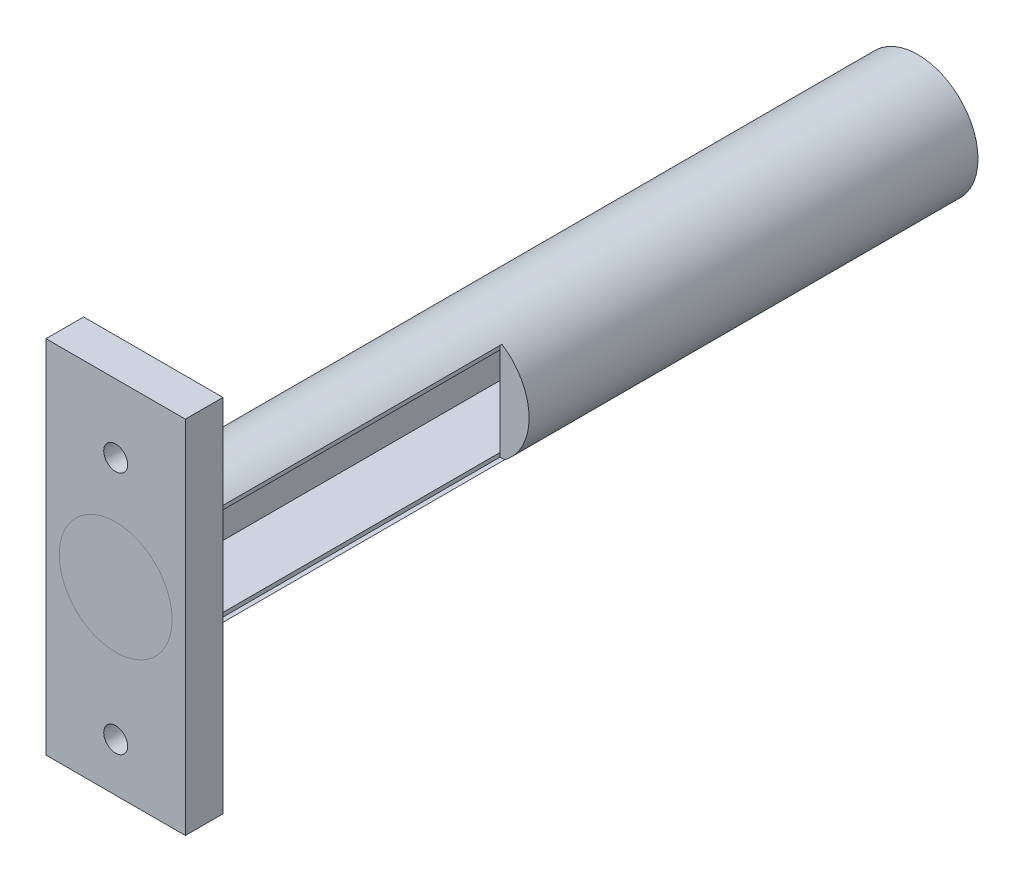
ISO-10303-21;
HEADER;
FILE_DESCRIPTION(('STEP AP214'),'2;1');
FILE_NAME('part.step','',(''),(''),'','','');
FILE_SCHEMA(('AUTOMOTIVE_DESIGN { 1 0 10303 214 1 1 1 1 }'));
ENDSEC;
DATA;
#1=APPLICATION_CONTEXT('core data for automotive mechanical design processes');
#2=APPLICATION_PROTOCOL_DEFINITION('international standard','automotive_design',2000,#1);
#3=PRODUCT_CONTEXT('',#1,'mechanical');
#4=PRODUCT('Part','Part','',(#3));
#5=PRODUCT_RELATED_PRODUCT_CATEGORY('part','',(#4));
#6=PRODUCT_DEFINITION_FORMATION('','',#4);
#7=PRODUCT_DEFINITION_CONTEXT('part definition',#1,'design');
#8=PRODUCT_DEFINITION('design','',#6,#7);
#9=PRODUCT_DEFINITION_SHAPE('','',#8);
#10=(LENGTH_UNIT() NAMED_UNIT(*) SI_UNIT(.MILLI.,.METRE.));
#11=(NAMED_UNIT(*) PLANE_ANGLE_UNIT() SI_UNIT($,.RADIAN.));
#12=(NAMED_UNIT(*) SI_UNIT($,.STERADIAN.) SOLID_ANGLE_UNIT());
#13=UNCERTAINTY_MEASURE_WITH_UNIT(LENGTH_MEASURE(1.E-05),#10,'distance_accuracy_value','');
#14=(GEOMETRIC_REPRESENTATION_CONTEXT(3) GLOBAL_UNCERTAINTY_ASSIGNED_CONTEXT((#13)) GLOBAL_UNIT_ASSIGNED_CONTEXT((#10,
#11,#12)) REPRESENTATION_CONTEXT('',''));
#15=CARTESIAN_POINT('',(0.,0.,0.));
#16=DIRECTION('',(0.,0.,1.));
#17=DIRECTION('',(1.,0.,0.));
#18=AXIS2_PLACEMENT_3D('',#15,#16,#17);
#19=CARTESIAN_POINT('',(4.1400160952072,-5.90118643022332,100.));
#20=DIRECTION('',(1.,0.,0.));
#21=DIRECTION('',(0.,0.,-1.));
#22=AXIS2_PLACEMENT_3D('',#19,#20,#21);
#23=PLANE('',#22);
#24=DIRECTION('',(0.,-1.,0.));
#25=VECTOR('',#24,1.);
#26=CARTESIAN_POINT('',(4.1400160952072,-6.44277888737755,59.6569720384821));
#27=LINE('',#26,#25);
#28=CARTESIAN_POINT('',(4.1400160952072,5.90118643022332,59.6569720384821));
#29=VERTEX_POINT('',#28);
#30=CARTESIAN_POINT('',(4.1400160952072,-5.90118643022332,59.6569720384821));
#31=VERTEX_POINT('',#30);
#32=EDGE_CURVE('E214',#29,#31,#27,.T.);
#33=ORIENTED_EDGE('',*,*,#32,.F.);
#34=DIRECTION('',(0.,0.,-1.));
#35=VECTOR('',#34,1.);
#36=CARTESIAN_POINT('',(4.1400160952072,5.90118643022332,100.));
#37=LINE('',#36,#35);
#38=CARTESIAN_POINT('',(4.1400160952072,5.90118643022332,4.));
#39=VERTEX_POINT('',#38);
#40=EDGE_CURVE('E277',#29,#39,#37,.T.);
#41=ORIENTED_EDGE('',*,*,#40,.T.);
#42=DIRECTION('',(0.,-1.,0.));
#43=VECTOR('',#42,1.);
#44=CARTESIAN_POINT('',(4.1400160952072,-5.90118643022332,4.));
#45=LINE('',#44,#43);
#46=CARTESIAN_POINT('',(4.1400160952072,-5.90118643022332,4.));
#47=VERTEX_POINT('',#46);
#48=EDGE_CURVE('E230',#39,#47,#45,.T.);
#49=ORIENTED_EDGE('',*,*,#48,.T.);
#50=DIRECTION('',(0.,0.,-1.));
#51=VECTOR('',#50,1.);
#52=CARTESIAN_POINT('',(4.1400160952072,-5.90118643022332,100.));
#53=LINE('',#52,#51);
#54=EDGE_CURVE('E257',#31,#47,#53,.T.);
#55=ORIENTED_EDGE('',*,*,#54,.F.);
#56=EDGE_LOOP('',(#33,#41,#49,#55));
#57=FACE_BOUND('',#56,.T.);
#58=ADVANCED_FACE('F41',(#57),#23,.F.);
#59=CARTESIAN_POINT('',(0.,0.,101.6));
#60=DIRECTION('',(0.,0.,-1.));
#61=DIRECTION('',(-1.,0.,0.));
#62=AXIS2_PLACEMENT_3D('',#59,#60,#61);
#63=CYLINDRICAL_SURFACE('',#62,8.);
#64=DIRECTION('',(0.,0.,-1.));
#65=VECTOR('',#64,1.);
#66=CARTESIAN_POINT('',(-5.82160820751879,5.4871557184164,101.6));
#67=LINE('',#66,#65);
#68=CARTESIAN_POINT('',(-5.82160820751879,5.4871557184164,95.8172403209971));
#69=VERTEX_POINT('',#68);
#70=CARTESIAN_POINT('',(-5.82160820751879,5.4871557184164,98.3733791189536));
#71=VERTEX_POINT('',#70);
#72=EDGE_CURVE('E201',#69,#71,#67,.F.);
#73=ORIENTED_EDGE('',*,*,#72,.T.);
#74=CARTESIAN_POINT('',(0.,0.,98.3733791189536));
#75=DIRECTION('',(0.,0.,1.));
#76=DIRECTION('',(1.,0.,0.));
#77=AXIS2_PLACEMENT_3D('',#74,#75,#76);
#78=CIRCLE('',#77,8.);
#79=CARTESIAN_POINT('',(-5.82160820751879,-5.4871557184164,98.3733791189536));
#80=VERTEX_POINT('',#79);
#81=EDGE_CURVE('E205',#71,#80,#78,.T.);
#82=ORIENTED_EDGE('',*,*,#81,.T.);
#83=DIRECTION('',(0.,0.,-1.));
#84=VECTOR('',#83,1.);
#85=CARTESIAN_POINT('',(-5.82160820751879,-5.4871557184164,101.6));
#86=LINE('',#85,#84);
#87=CARTESIAN_POINT('',(-5.82160820751879,-5.4871557184164,95.8172403209971));
#88=VERTEX_POINT('',#87);
#89=EDGE_CURVE('E192',#80,#88,#86,.T.);
#90=ORIENTED_EDGE('',*,*,#89,.T.);
#91=CARTESIAN_POINT('',(0.,0.,95.8172403209971));
#92=DIRECTION('',(0.,0.,-1.));
#93=DIRECTION('',(-1.,0.,0.));
#94=AXIS2_PLACEMENT_3D('',#91,#92,#93);
#95=CIRCLE('',#94,8.);
#96=EDGE_CURVE('E167',#88,#69,#95,.T.);
#97=ORIENTED_EDGE('',*,*,#96,.T.);
#98=EDGE_LOOP('',(#73,#82,#90,#97));
#99=FACE_BOUND('',#98,.T.);
#100=DIRECTION('',(0.,0.,-1.));
#101=VECTOR('',#100,1.);
#102=CARTESIAN_POINT('',(4.40136366689811,6.68041898923333,101.6));
#103=LINE('',#102,#101);
#104=CARTESIAN_POINT('',(4.40136366689811,6.68041898923333,100.347301698491));
#105=VERTEX_POINT('',#104);
#106=CARTESIAN_POINT('',(4.4013636668981,6.68041898923332,59.6569720384821));
#107=VERTEX_POINT('',#106);
#108=EDGE_CURVE('E50',#105,#107,#103,.T.);
#109=ORIENTED_EDGE('',*,*,#108,.T.);
#110=CARTESIAN_POINT('',(0.,0.,59.6569720384821));
#111=DIRECTION('',(0.,0.,-1.));
#112=DIRECTION('',(-1.,0.,0.));
#113=AXIS2_PLACEMENT_3D('',#110,#111,#112);
#114=CIRCLE('',#113,8.);
#115=CARTESIAN_POINT('',(4.74242556171019,-6.44277888737755,59.6569720384821));
#116=VERTEX_POINT('',#115);
#117=EDGE_CURVE('E11',#107,#116,#114,.T.);
#118=ORIENTED_EDGE('',*,*,#117,.T.);
#119=DIRECTION('',(0.,0.,-1.));
#120=VECTOR('',#119,1.);
#121=CARTESIAN_POINT('',(4.74242556171019,-6.44277888737754,101.6));
#122=LINE('',#121,#120);
#123=CARTESIAN_POINT('',(4.74242556171019,-6.44277888737754,100.347301698491));
#124=VERTEX_POINT('',#123);
#125=EDGE_CURVE('E320',#116,#124,#122,.F.);
#126=ORIENTED_EDGE('',*,*,#125,.T.);
#127=CARTESIAN_POINT('',(0.,0.,100.347301698491));
#128=DIRECTION('',(0.,0.,1.));
#129=DIRECTION('',(1.,0.,0.));
#130=AXIS2_PLACEMENT_3D('',#127,#128,#129);
#131=CIRCLE('',#130,8.);
#132=EDGE_CURVE('E373',#124,#105,#131,.T.);
#133=ORIENTED_EDGE('',*,*,#132,.T.);
#134=EDGE_LOOP('',(#109,#118,#126,#133));
#135=FACE_BOUND('',#134,.T.);
#136=CARTESIAN_POINT('',(0.,0.,101.6));
#137=DIRECTION('',(0.,0.,1.));
#138=DIRECTION('',(1.,0.,0.));
#139=AXIS2_PLACEMENT_3D('',#136,#137,#138);
#140=CIRCLE('',#139,8.);
#141=CARTESIAN_POINT('',(8.,0.,101.6));
#142=VERTEX_POINT('',#141);
#143=EDGE_CURVE('E321',#142,#142,#140,.T.);
#144=ORIENTED_EDGE('',*,*,#143,.F.);
#145=EDGE_LOOP('',(#144));
#146=FACE_BOUND('',#145,.T.);
#147=CARTESIAN_POINT('',(0.,0.,0.));
#148=DIRECTION('',(0.,0.,1.));
#149=DIRECTION('',(1.,0.,0.));
#150=AXIS2_PLACEMENT_3D('',#147,#148,#149);
#151=CIRCLE('',#150,8.);
#152=CARTESIAN_POINT('',(8.,0.,0.));
#153=VERTEX_POINT('',#152);
#154=EDGE_CURVE('E363',#153,#153,#151,.T.);
#155=ORIENTED_EDGE('',*,*,#154,.T.);
#156=EDGE_LOOP('',(#155));
#157=FACE_BOUND('',#156,.T.);
#158=ADVANCED_FACE('F43',(#99,#135,#146,#157),#63,.T.);
#159=CARTESIAN_POINT('',(0.,0.,0.));
#160=DIRECTION('',(0.,0.,1.));
#161=DIRECTION('',(1.,0.,0.));
#162=AXIS2_PLACEMENT_3D('',#159,#160,#161);
#163=PLANE('',#162);
#164=CARTESIAN_POINT('',(0.,0.,0.));
#165=DIRECTION('',(0.,0.,-1.));
#166=DIRECTION('',(-1.,0.,0.));
#167=AXIS2_PLACEMENT_3D('',#164,#165,#166);
#168=CIRCLE('',#167,3.185);
#169=CARTESIAN_POINT('',(-3.185,0.,0.));
#170=VERTEX_POINT('',#169);
#171=EDGE_CURVE('E291',#170,#170,#168,.T.);
#172=ORIENTED_EDGE('',*,*,#171,.F.);
#173=EDGE_LOOP('',(#172));
#174=FACE_BOUND('',#173,.T.);
#175=ORIENTED_EDGE('',*,*,#154,.F.);
#176=EDGE_LOOP('',(#175));
#177=FACE_BOUND('',#176,.T.);
#178=ADVANCED_FACE('F438',(#174,#177),#163,.F.);
#179=CARTESIAN_POINT('',(-9.25982346558385,-23.9637087374263,106.6));
#180=DIRECTION('',(1.,0.,0.));
#181=DIRECTION('',(0.,0.,-1.));
#182=AXIS2_PLACEMENT_3D('',#179,#180,#181);
#183=PLANE('',#182);
#184=DIRECTION('',(0.,-1.,0.));
#185=VECTOR('',#184,1.);
#186=CARTESIAN_POINT('',(-9.25982346558385,-23.9637087374263,101.6));
#187=LINE('',#186,#185);
#188=CARTESIAN_POINT('',(-9.25982346558385,23.9637087374263,101.6));
#189=VERTEX_POINT('',#188);
#190=CARTESIAN_POINT('',(-9.25982346558385,-23.9637087374263,101.6));
#191=VERTEX_POINT('',#190);
#192=EDGE_CURVE('E315',#189,#191,#187,.T.);
#193=ORIENTED_EDGE('',*,*,#192,.T.);
#194=DIRECTION('',(0.,0.,-1.));
#195=VECTOR('',#194,1.);
#196=CARTESIAN_POINT('',(-9.25982346558385,-23.9637087374263,106.6));
#197=LINE('',#196,#195);
#198=CARTESIAN_POINT('',(-9.25982346558385,-23.9637087374263,106.6));
#199=VERTEX_POINT('',#198);
#200=EDGE_CURVE('E359',#199,#191,#197,.T.);
#201=ORIENTED_EDGE('',*,*,#200,.F.);
#202=DIRECTION('',(0.,-1.,0.));
#203=VECTOR('',#202,1.);
#204=CARTESIAN_POINT('',(-9.25982346558385,-23.9637087374263,106.6));
#205=LINE('',#204,#203);
#206=CARTESIAN_POINT('',(-9.25982346558385,23.9637087374263,106.6));
#207=VERTEX_POINT('',#206);
#208=EDGE_CURVE('E322',#207,#199,#205,.T.);
#209=ORIENTED_EDGE('',*,*,#208,.F.);
#210=DIRECTION('',(0.,0.,-1.));
#211=VECTOR('',#210,1.);
#212=CARTESIAN_POINT('',(-9.25982346558385,23.9637087374263,106.6));
#213=LINE('',#212,#211);
#214=EDGE_CURVE('E336',#207,#189,#213,.T.);
#215=ORIENTED_EDGE('',*,*,#214,.T.);
#216=EDGE_LOOP('',(#193,#201,#209,#215));
#217=FACE_BOUND('',#216,.T.);
#218=ADVANCED_FACE('F481',(#217),#183,.F.);
#219=CARTESIAN_POINT('',(9.25982346558385,-23.9637087374263,106.6));
#220=DIRECTION('',(0.,1.,0.));
#221=DIRECTION('',(0.,0.,1.));
#222=AXIS2_PLACEMENT_3D('',#219,#220,#221);
#223=PLANE('',#222);
#224=DIRECTION('',(1.,0.,0.));
#225=VECTOR('',#224,1.);
#226=CARTESIAN_POINT('',(9.25982346558385,-23.9637087374263,101.6));
#227=LINE('',#226,#225);
#228=CARTESIAN_POINT('',(9.25982346558385,-23.9637087374263,101.6));
#229=VERTEX_POINT('',#228);
#230=EDGE_CURVE('E340',#191,#229,#227,.T.);
#231=ORIENTED_EDGE('',*,*,#230,.T.);
#232=DIRECTION('',(0.,0.,-1.));
#233=VECTOR('',#232,1.);
#234=CARTESIAN_POINT('',(9.25982346558385,-23.9637087374263,106.6));
#235=LINE('',#234,#233);
#236=CARTESIAN_POINT('',(9.25982346558385,-23.9637087374263,106.6));
#237=VERTEX_POINT('',#236);
#238=EDGE_CURVE('E355',#237,#229,#235,.T.);
#239=ORIENTED_EDGE('',*,*,#238,.F.);
#240=DIRECTION('',(1.,0.,0.));
#241=VECTOR('',#240,1.);
#242=CARTESIAN_POINT('',(9.25982346558385,-23.9637087374263,106.6));
#243=LINE('',#242,#241);
#244=EDGE_CURVE('E326',#199,#237,#243,.T.);
#245=ORIENTED_EDGE('',*,*,#244,.F.);
#246=ORIENTED_EDGE('',*,*,#200,.T.);
#247=EDGE_LOOP('',(#231,#239,#245,#246));
#248=FACE_BOUND('',#247,.T.);
#249=ADVANCED_FACE('F477',(#248),#223,.F.);
#250=CARTESIAN_POINT('',(9.25982346558385,-23.9637087374263,106.6));
#251=DIRECTION('',(-1.,0.,0.));
#252=DIRECTION('',(0.,0.,1.));
#253=AXIS2_PLACEMENT_3D('',#250,#251,#252);
#254=PLANE('',#253);
#255=DIRECTION('',(0.,1.,0.));
#256=VECTOR('',#255,1.);
#257=CARTESIAN_POINT('',(9.25982346558385,-23.9637087374263,101.6));
#258=LINE('',#257,#256);
#259=CARTESIAN_POINT('',(9.25982346558385,23.9637087374263,101.6));
#260=VERTEX_POINT('',#259);
#261=EDGE_CURVE('E343',#229,#260,#258,.T.);
#262=ORIENTED_EDGE('',*,*,#261,.T.);
#263=DIRECTION('',(0.,0.,-1.));
#264=VECTOR('',#263,1.);
#265=CARTESIAN_POINT('',(9.25982346558385,23.9637087374263,106.6));
#266=LINE('',#265,#264);
#267=CARTESIAN_POINT('',(9.25982346558385,23.9637087374263,106.6));
#268=VERTEX_POINT('',#267);
#269=EDGE_CURVE('E351',#268,#260,#266,.T.);
#270=ORIENTED_EDGE('',*,*,#269,.F.);
#271=DIRECTION('',(0.,1.,0.));
#272=VECTOR('',#271,1.);
#273=CARTESIAN_POINT('',(9.25982346558385,-23.9637087374263,106.6));
#274=LINE('',#273,#272);
#275=EDGE_CURVE('E330',#237,#268,#274,.T.);
#276=ORIENTED_EDGE('',*,*,#275,.F.);
#277=ORIENTED_EDGE('',*,*,#238,.T.);
#278=EDGE_LOOP('',(#262,#270,#276,#277));
#279=FACE_BOUND('',#278,.T.);
#280=ADVANCED_FACE('F473',(#279),#254,.F.);
#281=CARTESIAN_POINT('',(9.25982346558385,23.9637087374263,106.6));
#282=DIRECTION('',(0.,-1.,0.));
#283=DIRECTION('',(0.,0.,-1.));
#284=AXIS2_PLACEMENT_3D('',#281,#282,#283);
#285=PLANE('',#284);
#286=DIRECTION('',(-1.,0.,0.));
#287=VECTOR('',#286,1.);
#288=CARTESIAN_POINT('',(9.25982346558385,23.9637087374263,101.6));
#289=LINE('',#288,#287);
#290=EDGE_CURVE('E327',#260,#189,#289,.T.);
#291=ORIENTED_EDGE('',*,*,#290,.T.);
#292=ORIENTED_EDGE('',*,*,#214,.F.);
#293=DIRECTION('',(-1.,0.,0.));
#294=VECTOR('',#293,1.);
#295=CARTESIAN_POINT('',(9.25982346558385,23.9637087374263,106.6));
#296=LINE('',#295,#294);
#297=EDGE_CURVE('E333',#268,#207,#296,.T.);
#298=ORIENTED_EDGE('',*,*,#297,.F.);
#299=ORIENTED_EDGE('',*,*,#269,.T.);
#300=EDGE_LOOP('',(#291,#292,#298,#299));
#301=FACE_BOUND('',#300,.T.);
#302=ADVANCED_FACE('F466',(#301),#285,.F.);
#303=CARTESIAN_POINT('',(0.,0.,106.6));
#304=DIRECTION('',(0.,0.,1.));
#305=DIRECTION('',(1.,0.,0.));
#306=AXIS2_PLACEMENT_3D('',#303,#304,#305);
#307=PLANE('',#306);
#308=CARTESIAN_POINT('',(0.,14.8830919482618,106.6));
#309=DIRECTION('',(0.,0.,1.));
#310=DIRECTION('',(1.,0.,0.));
#311=AXIS2_PLACEMENT_3D('',#308,#309,#310);
#312=CIRCLE('',#311,1.59);
#313=CARTESIAN_POINT('',(1.59,14.8830919482618,106.6));
#314=VERTEX_POINT('',#313);
#315=EDGE_CURVE('E307',#314,#314,#312,.T.);
#316=ORIENTED_EDGE('',*,*,#315,.F.);
#317=EDGE_LOOP('',(#316));
#318=FACE_BOUND('',#317,.T.);
#319=CARTESIAN_POINT('',(0.,-17.5238782385582,106.6));
#320=DIRECTION('',(0.,0.,1.));
#321=DIRECTION('',(1.,0.,0.));
#322=AXIS2_PLACEMENT_3D('',#319,#320,#321);
#323=CIRCLE('',#322,1.59);
#324=CARTESIAN_POINT('',(1.59,-17.5238782385582,106.6));
#325=VERTEX_POINT('',#324);
#326=EDGE_CURVE('E300',#325,#325,#323,.T.);
#327=ORIENTED_EDGE('',*,*,#326,.F.);
#328=EDGE_LOOP('',(#327));
#329=FACE_BOUND('',#328,.T.);
#330=CARTESIAN_POINT('',(0.,0.,106.6));
#331=DIRECTION('',(0.,0.,1.));
#332=DIRECTION('',(1.,0.,0.));
#333=AXIS2_PLACEMENT_3D('',#330,#331,#332);
#334=CIRCLE('',#333,7.5);
#335=CARTESIAN_POINT('',(7.5,0.,106.6));
#336=VERTEX_POINT('',#335);
#337=EDGE_CURVE('E316',#336,#336,#334,.T.);
#338=ORIENTED_EDGE('',*,*,#337,.F.);
#339=EDGE_LOOP('',(#338));
#340=FACE_BOUND('',#339,.T.);
#341=ORIENTED_EDGE('',*,*,#208,.T.);
#342=ORIENTED_EDGE('',*,*,#244,.T.);
#343=ORIENTED_EDGE('',*,*,#275,.T.);
#344=ORIENTED_EDGE('',*,*,#297,.T.);
#345=EDGE_LOOP('',(#341,#342,#343,#344));
#346=FACE_BOUND('',#345,.T.);
#347=ADVANCED_FACE('F463',(#318,#329,#340,#346),#307,.T.);
#348=CARTESIAN_POINT('',(0.,0.,101.6));
#349=DIRECTION('',(0.,0.,1.));
#350=DIRECTION('',(1.,0.,0.));
#351=AXIS2_PLACEMENT_3D('',#348,#349,#350);
#352=PLANE('',#351);
#353=CARTESIAN_POINT('',(0.,14.8830919482618,101.6));
#354=DIRECTION('',(0.,0.,-1.));
#355=DIRECTION('',(-1.,0.,0.));
#356=AXIS2_PLACEMENT_3D('',#353,#354,#355);
#357=CIRCLE('',#356,1.59);
#358=CARTESIAN_POINT('',(-1.59,14.8830919482618,101.6));
#359=VERTEX_POINT('',#358);
#360=EDGE_CURVE('E296',#359,#359,#357,.T.);
#361=ORIENTED_EDGE('',*,*,#360,.F.);
#362=EDGE_LOOP('',(#361));
#363=FACE_BOUND('',#362,.T.);
#364=CARTESIAN_POINT('',(0.,-17.5238782385582,101.6));
#365=DIRECTION('',(0.,0.,-1.));
#366=DIRECTION('',(-1.,0.,0.));
#367=AXIS2_PLACEMENT_3D('',#364,#365,#366);
#368=CIRCLE('',#367,1.59);
#369=CARTESIAN_POINT('',(-1.59,-17.5238782385582,101.6));
#370=VERTEX_POINT('',#369);
#371=EDGE_CURVE('E295',#370,#370,#368,.T.);
#372=ORIENTED_EDGE('',*,*,#371,.F.);
#373=EDGE_LOOP('',(#372));
#374=FACE_BOUND('',#373,.T.);
#375=ORIENTED_EDGE('',*,*,#143,.T.);
#376=EDGE_LOOP('',(#375));
#377=FACE_BOUND('',#376,.T.);
#378=ORIENTED_EDGE('',*,*,#192,.F.);
#379=ORIENTED_EDGE('',*,*,#290,.F.);
#380=ORIENTED_EDGE('',*,*,#261,.F.);
#381=ORIENTED_EDGE('',*,*,#230,.F.);
#382=EDGE_LOOP('',(#378,#379,#380,#381));
#383=FACE_BOUND('',#382,.T.);
#384=ADVANCED_FACE('F461',(#363,#374,#377,#383),#352,.F.);
#385=CARTESIAN_POINT('',(0.,0.,106.6001));
#386=DIRECTION('',(0.,0.,-1.));
#387=DIRECTION('',(-1.,0.,0.));
#388=AXIS2_PLACEMENT_3D('',#385,#386,#387);
#389=CYLINDRICAL_SURFACE('',#388,7.5);
#390=CARTESIAN_POINT('',(0.,0.,106.6001));
#391=DIRECTION('',(0.,0.,1.));
#392=DIRECTION('',(1.,0.,0.));
#393=AXIS2_PLACEMENT_3D('',#390,#391,#392);
#394=CIRCLE('',#393,7.5);
#395=CARTESIAN_POINT('',(7.5,0.,106.6001));
#396=VERTEX_POINT('',#395);
#397=EDGE_CURVE('E311',#396,#396,#394,.T.);
#398=ORIENTED_EDGE('',*,*,#397,.F.);
#399=EDGE_LOOP('',(#398));
#400=FACE_BOUND('',#399,.T.);
#401=ORIENTED_EDGE('',*,*,#337,.T.);
#402=EDGE_LOOP('',(#401));
#403=FACE_BOUND('',#402,.T.);
#404=ADVANCED_FACE('F457',(#400,#403),#389,.T.);
#405=CARTESIAN_POINT('',(0.,0.,106.6001));
#406=DIRECTION('',(0.,0.,1.));
#407=DIRECTION('',(1.,0.,0.));
#408=AXIS2_PLACEMENT_3D('',#405,#406,#407);
#409=PLANE('',#408);
#410=ORIENTED_EDGE('',*,*,#397,.T.);
#411=EDGE_LOOP('',(#410));
#412=FACE_BOUND('',#411,.T.);
#413=ADVANCED_FACE('F453',(#412),#409,.T.);
#414=CARTESIAN_POINT('',(0.,-17.5238782385582,135.6));
#415=DIRECTION('',(0.,0.,-1.));
#416=DIRECTION('',(-1.,0.,0.));
#417=AXIS2_PLACEMENT_3D('',#414,#415,#416);
#418=CYLINDRICAL_SURFACE('',#417,1.59);
#419=ORIENTED_EDGE('',*,*,#326,.T.);
#420=EDGE_LOOP('',(#419));
#421=FACE_BOUND('',#420,.T.);
#422=ORIENTED_EDGE('',*,*,#371,.T.);
#423=EDGE_LOOP('',(#422));
#424=FACE_BOUND('',#423,.T.);
#425=ADVANCED_FACE('F449',(#421,#424),#418,.F.);
#426=CARTESIAN_POINT('',(0.,14.8830919482618,135.6));
#427=DIRECTION('',(0.,0.,-1.));
#428=DIRECTION('',(-1.,0.,0.));
#429=AXIS2_PLACEMENT_3D('',#426,#427,#428);
#430=CYLINDRICAL_SURFACE('',#429,1.59);
#431=ORIENTED_EDGE('',*,*,#315,.T.);
#432=EDGE_LOOP('',(#431));
#433=FACE_BOUND('',#432,.T.);
#434=ORIENTED_EDGE('',*,*,#360,.T.);
#435=EDGE_LOOP('',(#434));
#436=FACE_BOUND('',#435,.T.);
#437=ADVANCED_FACE('F445',(#433,#436),#430,.F.);
#438=CARTESIAN_POINT('',(0.,0.,4.));
#439=DIRECTION('',(0.,0.,-1.));
#440=DIRECTION('',(-1.,0.,0.));
#441=AXIS2_PLACEMENT_3D('',#438,#439,#440);
#442=CYLINDRICAL_SURFACE('',#441,3.185);
#443=CARTESIAN_POINT('',(0.,0.,4.));
#444=DIRECTION('',(0.,0.,-1.));
#445=DIRECTION('',(-1.,0.,0.));
#446=AXIS2_PLACEMENT_3D('',#443,#444,#445);
#447=CIRCLE('',#446,3.185);
#448=CARTESIAN_POINT('',(-3.185,0.,4.));
#449=VERTEX_POINT('',#448);
#450=EDGE_CURVE('E276',#449,#449,#447,.T.);
#451=ORIENTED_EDGE('',*,*,#450,.F.);
#452=EDGE_LOOP('',(#451));
#453=FACE_BOUND('',#452,.T.);
#454=ORIENTED_EDGE('',*,*,#171,.T.);
#455=EDGE_LOOP('',(#454));
#456=FACE_BOUND('',#455,.T.);
#457=ADVANCED_FACE('F442',(#453,#456),#442,.F.);
#458=CARTESIAN_POINT('',(-4.1400160952072,5.90118643022332,100.));
#459=DIRECTION('',(0.,1.,0.));
#460=DIRECTION('',(0.,0.,1.));
#461=AXIS2_PLACEMENT_3D('',#458,#459,#460);
#462=PLANE('',#461);
#463=DIRECTION('',(1.,0.,0.));
#464=VECTOR('',#463,1.);
#465=CARTESIAN_POINT('',(-4.1400160952072,5.90118643022332,4.));
#466=LINE('',#465,#464);
#467=CARTESIAN_POINT('',(-4.1400160952072,5.90118643022332,4.));
#468=VERTEX_POINT('',#467);
#469=EDGE_CURVE('E245',#468,#39,#466,.T.);
#470=ORIENTED_EDGE('',*,*,#469,.T.);
#471=ORIENTED_EDGE('',*,*,#40,.F.);
#472=CARTESIAN_POINT('',(4.1400160952072,5.90118643022332,100.));
#473=VERTEX_POINT('',#472);
#474=EDGE_CURVE('E272',#473,#29,#37,.T.);
#475=ORIENTED_EDGE('',*,*,#474,.F.);
#476=DIRECTION('',(1.,0.,0.));
#477=VECTOR('',#476,1.);
#478=CARTESIAN_POINT('',(-4.1400160952072,5.90118643022332,100.));
#479=LINE('',#478,#477);
#480=CARTESIAN_POINT('',(-4.1400160952072,5.90118643022332,100.));
#481=VERTEX_POINT('',#480);
#482=EDGE_CURVE('E253',#481,#473,#479,.T.);
#483=ORIENTED_EDGE('',*,*,#482,.F.);
#484=DIRECTION('',(0.,0.,-1.));
#485=VECTOR('',#484,1.);
#486=CARTESIAN_POINT('',(-4.1400160952072,5.90118643022332,100.));
#487=LINE('',#486,#485);
#488=EDGE_CURVE('E278',#481,#468,#487,.T.);
#489=ORIENTED_EDGE('',*,*,#488,.T.);
#490=EDGE_LOOP('',(#470,#471,#475,#483,#489));
#491=FACE_BOUND('',#490,.T.);
#492=ADVANCED_FACE('F416',(#491),#462,.F.);
#493=CARTESIAN_POINT('',(-4.1400160952072,-5.90118643022332,100.));
#494=DIRECTION('',(-1.,0.,0.));
#495=DIRECTION('',(0.,0.,1.));
#496=AXIS2_PLACEMENT_3D('',#493,#494,#495);
#497=PLANE('',#496);
#498=DIRECTION('',(0.,0.,-1.));
#499=VECTOR('',#498,1.);
#500=CARTESIAN_POINT('',(-4.1400160952072,-5.4871557184164,95.8172403209971));
#501=LINE('',#500,#499);
#502=CARTESIAN_POINT('',(-4.1400160952072,-5.4871557184164,98.3733791189536));
#503=VERTEX_POINT('',#502);
#504=CARTESIAN_POINT('',(-4.1400160952072,-5.4871557184164,95.8172403209971));
#505=VERTEX_POINT('',#504);
#506=EDGE_CURVE('E174',#503,#505,#501,.T.);
#507=ORIENTED_EDGE('',*,*,#506,.F.);
#508=DIRECTION('',(0.,-1.,0.));
#509=VECTOR('',#508,1.);
#510=CARTESIAN_POINT('',(-4.1400160952072,5.4871557184164,98.3733791189536));
#511=LINE('',#510,#509);
#512=CARTESIAN_POINT('',(-4.1400160952072,5.4871557184164,98.3733791189536));
#513=VERTEX_POINT('',#512);
#514=EDGE_CURVE('E65',#513,#503,#511,.T.);
#515=ORIENTED_EDGE('',*,*,#514,.F.);
#516=DIRECTION('',(0.,0.,1.));
#517=VECTOR('',#516,1.);
#518=CARTESIAN_POINT('',(-4.1400160952072,5.4871557184164,95.8172403209971));
#519=LINE('',#518,#517);
#520=CARTESIAN_POINT('',(-4.1400160952072,5.4871557184164,95.8172403209971));
#521=VERTEX_POINT('',#520);
#522=EDGE_CURVE('E182',#521,#513,#519,.T.);
#523=ORIENTED_EDGE('',*,*,#522,.F.);
#524=DIRECTION('',(0.,1.,0.));
#525=VECTOR('',#524,1.);
#526=CARTESIAN_POINT('',(-4.1400160952072,5.4871557184164,95.8172403209971));
#527=LINE('',#526,#525);
#528=EDGE_CURVE('E164',#505,#521,#527,.T.);
#529=ORIENTED_EDGE('',*,*,#528,.F.);
#530=EDGE_LOOP('',(#507,#515,#523,#529));
#531=FACE_BOUND('',#530,.T.);
#532=DIRECTION('',(0.,1.,0.));
#533=VECTOR('',#532,1.);
#534=CARTESIAN_POINT('',(-4.1400160952072,-5.90118643022332,4.));
#535=LINE('',#534,#533);
#536=CARTESIAN_POINT('',(-4.1400160952072,-5.90118643022332,4.));
#537=VERTEX_POINT('',#536);
#538=EDGE_CURVE('E265',#537,#468,#535,.T.);
#539=ORIENTED_EDGE('',*,*,#538,.T.);
#540=ORIENTED_EDGE('',*,*,#488,.F.);
#541=DIRECTION('',(0.,1.,0.));
#542=VECTOR('',#541,1.);
#543=CARTESIAN_POINT('',(-4.1400160952072,-5.90118643022332,100.));
#544=LINE('',#543,#542);
#545=CARTESIAN_POINT('',(-4.1400160952072,-5.90118643022332,100.));
#546=VERTEX_POINT('',#545);
#547=EDGE_CURVE('E249',#546,#481,#544,.T.);
#548=ORIENTED_EDGE('',*,*,#547,.F.);
#549=DIRECTION('',(0.,0.,-1.));
#550=VECTOR('',#549,1.);
#551=CARTESIAN_POINT('',(-4.1400160952072,-5.90118643022332,100.));
#552=LINE('',#551,#550);
#553=EDGE_CURVE('E281',#546,#537,#552,.T.);
#554=ORIENTED_EDGE('',*,*,#553,.T.);
#555=EDGE_LOOP('',(#539,#540,#548,#554));
#556=FACE_BOUND('',#555,.T.);
#557=ADVANCED_FACE('F179',(#531,#556),#497,.F.);
#558=CARTESIAN_POINT('',(-4.1400160952072,-5.90118643022332,100.));
#559=DIRECTION('',(0.,-1.,0.));
#560=DIRECTION('',(0.,0.,-1.));
#561=AXIS2_PLACEMENT_3D('',#558,#559,#560);
#562=PLANE('',#561);
#563=DIRECTION('',(-1.,0.,0.));
#564=VECTOR('',#563,1.);
#565=CARTESIAN_POINT('',(-4.1400160952072,-5.90118643022332,4.));
#566=LINE('',#565,#564);
#567=EDGE_CURVE('E261',#47,#537,#566,.T.);
#568=ORIENTED_EDGE('',*,*,#567,.T.);
#569=ORIENTED_EDGE('',*,*,#553,.F.);
#570=DIRECTION('',(-1.,0.,0.));
#571=VECTOR('',#570,1.);
#572=CARTESIAN_POINT('',(-4.1400160952072,-5.90118643022332,100.));
#573=LINE('',#572,#571);
#574=CARTESIAN_POINT('',(4.1400160952072,-5.90118643022332,100.));
#575=VERTEX_POINT('',#574);
#576=EDGE_CURVE('E244',#575,#546,#573,.T.);
#577=ORIENTED_EDGE('',*,*,#576,.F.);
#578=EDGE_CURVE('E284',#575,#31,#53,.T.);
#579=ORIENTED_EDGE('',*,*,#578,.T.);
#580=ORIENTED_EDGE('',*,*,#54,.T.);
#581=EDGE_LOOP('',(#568,#569,#577,#579,#580));
#582=FACE_BOUND('',#581,.T.);
#583=ADVANCED_FACE('F420',(#582),#562,.F.);
#584=CARTESIAN_POINT('',(0.,0.,100.));
#585=DIRECTION('',(0.,0.,-1.));
#586=DIRECTION('',(-1.,0.,0.));
#587=AXIS2_PLACEMENT_3D('',#584,#585,#586);
#588=PLANE('',#587);
#589=DIRECTION('',(0.,-1.,0.));
#590=VECTOR('',#589,1.);
#591=CARTESIAN_POINT('',(4.1400160952072,-5.90118643022332,100.));
#592=LINE('',#591,#590);
#593=EDGE_CURVE('E240',#473,#575,#592,.T.);
#594=ORIENTED_EDGE('',*,*,#593,.T.);
#595=ORIENTED_EDGE('',*,*,#576,.T.);
#596=ORIENTED_EDGE('',*,*,#547,.T.);
#597=ORIENTED_EDGE('',*,*,#482,.T.);
#598=EDGE_LOOP('',(#594,#595,#596,#597));
#599=FACE_BOUND('',#598,.T.);
#600=ADVANCED_FACE('F422',(#599),#588,.T.);
#601=CARTESIAN_POINT('',(0.,0.,4.));
#602=DIRECTION('',(0.,0.,-1.));
#603=DIRECTION('',(-1.,0.,0.));
#604=AXIS2_PLACEMENT_3D('',#601,#602,#603);
#605=PLANE('',#604);
#606=ORIENTED_EDGE('',*,*,#450,.T.);
#607=EDGE_LOOP('',(#606));
#608=FACE_BOUND('',#607,.T.);
#609=ORIENTED_EDGE('',*,*,#48,.F.);
#610=ORIENTED_EDGE('',*,*,#469,.F.);
#611=ORIENTED_EDGE('',*,*,#538,.F.);
#612=ORIENTED_EDGE('',*,*,#567,.F.);
#613=EDGE_LOOP('',(#609,#610,#611,#612));
#614=FACE_BOUND('',#613,.T.);
#615=ADVANCED_FACE('F414',(#608,#614),#605,.F.);
#616=CARTESIAN_POINT('',(4.1400160952072,0.,0.));
#617=DIRECTION('',(-1.,0.,0.));
#618=DIRECTION('',(0.,0.,1.));
#619=AXIS2_PLACEMENT_3D('',#616,#617,#618);
#620=PLANE('',#619);
#621=ORIENTED_EDGE('',*,*,#593,.F.);
#622=ORIENTED_EDGE('',*,*,#474,.T.);
#623=CARTESIAN_POINT('',(4.1400160952072,6.68041898923332,59.6569720384821));
#624=VERTEX_POINT('',#623);
#625=EDGE_CURVE('E210',#624,#29,#27,.T.);
#626=ORIENTED_EDGE('',*,*,#625,.F.);
#627=DIRECTION('',(0.,0.,-1.));
#628=VECTOR('',#627,1.);
#629=CARTESIAN_POINT('',(4.1400160952072,6.68041898923333,100.347301698491));
#630=LINE('',#629,#628);
#631=CARTESIAN_POINT('',(4.1400160952072,6.68041898923333,100.347301698491));
#632=VERTEX_POINT('',#631);
#633=EDGE_CURVE('E222',#632,#624,#630,.T.);
#634=ORIENTED_EDGE('',*,*,#633,.F.);
#635=DIRECTION('',(0.,1.,0.));
#636=VECTOR('',#635,1.);
#637=CARTESIAN_POINT('',(4.1400160952072,-6.44277888737754,100.347301698491));
#638=LINE('',#637,#636);
#639=CARTESIAN_POINT('',(4.1400160952072,-6.44277888737754,100.347301698491));
#640=VERTEX_POINT('',#639);
#641=EDGE_CURVE('E218',#640,#632,#638,.T.);
#642=ORIENTED_EDGE('',*,*,#641,.F.);
#643=DIRECTION('',(0.,0.,1.));
#644=VECTOR('',#643,1.);
#645=CARTESIAN_POINT('',(4.1400160952072,-6.44277888737754,100.347301698491));
#646=LINE('',#645,#644);
#647=CARTESIAN_POINT('',(4.1400160952072,-6.44277888737755,59.6569720384821));
#648=VERTEX_POINT('',#647);
#649=EDGE_CURVE('E213',#648,#640,#646,.T.);
#650=ORIENTED_EDGE('',*,*,#649,.F.);
#651=EDGE_CURVE('E209',#31,#648,#27,.T.);
#652=ORIENTED_EDGE('',*,*,#651,.F.);
#653=ORIENTED_EDGE('',*,*,#578,.F.);
#654=EDGE_LOOP('',(#621,#622,#626,#634,#642,#650,#652,#653));
#655=FACE_BOUND('',#654,.T.);
#656=ADVANCED_FACE('F392',(#655),#620,.F.);
#657=CARTESIAN_POINT('',(39.1400160952072,-6.44277888737755,59.6569720384821));
#658=DIRECTION('',(0.,0.,-1.));
#659=DIRECTION('',(-1.,0.,0.));
#660=AXIS2_PLACEMENT_3D('',#657,#658,#659);
#661=PLANE('',#660);
#662=DIRECTION('',(-1.,0.,0.));
#663=VECTOR('',#662,1.);
#664=CARTESIAN_POINT('',(39.1400160952072,6.68041898923332,59.6569720384821));
#665=LINE('',#664,#663);
#666=EDGE_CURVE('E227',#107,#624,#665,.T.);
#667=ORIENTED_EDGE('',*,*,#666,.T.);
#668=ORIENTED_EDGE('',*,*,#625,.T.);
#669=ORIENTED_EDGE('',*,*,#32,.T.);
#670=ORIENTED_EDGE('',*,*,#651,.T.);
#671=DIRECTION('',(-1.,0.,0.));
#672=VECTOR('',#671,1.);
#673=CARTESIAN_POINT('',(39.1400160952072,-6.44277888737755,59.6569720384821));
#674=LINE('',#673,#672);
#675=EDGE_CURVE('E226',#116,#648,#674,.T.);
#676=ORIENTED_EDGE('',*,*,#675,.F.);
#677=ORIENTED_EDGE('',*,*,#117,.F.);
#678=EDGE_LOOP('',(#667,#668,#669,#670,#676,#677));
#679=FACE_BOUND('',#678,.T.);
#680=ADVANCED_FACE('F397',(#679),#661,.F.);
#681=CARTESIAN_POINT('',(39.1400160952072,6.68041898923333,100.347301698491));
#682=DIRECTION('',(0.,1.,0.));
#683=DIRECTION('',(0.,0.,1.));
#684=AXIS2_PLACEMENT_3D('',#681,#682,#683);
#685=PLANE('',#684);
#686=DIRECTION('',(-1.,0.,0.));
#687=VECTOR('',#686,1.);
#688=CARTESIAN_POINT('',(39.1400160952072,6.68041898923333,100.347301698491));
#689=LINE('',#688,#687);
#690=EDGE_CURVE('E231',#105,#632,#689,.T.);
#691=ORIENTED_EDGE('',*,*,#690,.T.);
#692=ORIENTED_EDGE('',*,*,#633,.T.);
#693=ORIENTED_EDGE('',*,*,#666,.F.);
#694=ORIENTED_EDGE('',*,*,#108,.F.);
#695=EDGE_LOOP('',(#691,#692,#693,#694));
#696=FACE_BOUND('',#695,.T.);
#697=ADVANCED_FACE('F384',(#696),#685,.F.);
#698=CARTESIAN_POINT('',(39.1400160952072,-6.44277888737754,100.347301698491));
#699=DIRECTION('',(0.,0.,1.));
#700=DIRECTION('',(1.,0.,0.));
#701=AXIS2_PLACEMENT_3D('',#698,#699,#700);
#702=PLANE('',#701);
#703=DIRECTION('',(-1.,0.,0.));
#704=VECTOR('',#703,1.);
#705=CARTESIAN_POINT('',(39.1400160952072,-6.44277888737754,100.347301698491));
#706=LINE('',#705,#704);
#707=EDGE_CURVE('E234',#124,#640,#706,.T.);
#708=ORIENTED_EDGE('',*,*,#707,.T.);
#709=ORIENTED_EDGE('',*,*,#641,.T.);
#710=ORIENTED_EDGE('',*,*,#690,.F.);
#711=ORIENTED_EDGE('',*,*,#132,.F.);
#712=EDGE_LOOP('',(#708,#709,#710,#711));
#713=FACE_BOUND('',#712,.T.);
#714=ADVANCED_FACE('F386',(#713),#702,.F.);
#715=CARTESIAN_POINT('',(39.1400160952072,-6.44277888737754,100.347301698491));
#716=DIRECTION('',(0.,-1.,0.));
#717=DIRECTION('',(0.,0.,-1.));
#718=AXIS2_PLACEMENT_3D('',#715,#716,#717);
#719=PLANE('',#718);
#720=ORIENTED_EDGE('',*,*,#675,.T.);
#721=ORIENTED_EDGE('',*,*,#649,.T.);
#722=ORIENTED_EDGE('',*,*,#707,.F.);
#723=ORIENTED_EDGE('',*,*,#125,.F.);
#724=EDGE_LOOP('',(#720,#721,#722,#723));
#725=FACE_BOUND('',#724,.T.);
#726=ADVANCED_FACE('F401',(#725),#719,.F.);
#727=CARTESIAN_POINT('',(-39.1400160952072,5.4871557184164,98.3733791189536));
#728=DIRECTION('',(0.,0.,1.));
#729=DIRECTION('',(1.,0.,0.));
#730=AXIS2_PLACEMENT_3D('',#727,#728,#729);
#731=PLANE('',#730);
#732=DIRECTION('',(1.,0.,0.));
#733=VECTOR('',#732,1.);
#734=CARTESIAN_POINT('',(-39.1400160952072,5.4871557184164,98.3733791189536));
#735=LINE('',#734,#733);
#736=EDGE_CURVE('E189',#71,#513,#735,.T.);
#737=ORIENTED_EDGE('',*,*,#736,.T.);
#738=ORIENTED_EDGE('',*,*,#514,.T.);
#739=DIRECTION('',(1.,0.,0.));
#740=VECTOR('',#739,1.);
#741=CARTESIAN_POINT('',(-39.1400160952072,-5.4871557184164,98.3733791189536));
#742=LINE('',#741,#740);
#743=EDGE_CURVE('E171',#80,#503,#742,.T.);
#744=ORIENTED_EDGE('',*,*,#743,.F.);
#745=ORIENTED_EDGE('',*,*,#81,.F.);
#746=EDGE_LOOP('',(#737,#738,#744,#745));
#747=FACE_BOUND('',#746,.T.);
#748=ADVANCED_FACE('F602',(#747),#731,.F.);
#749=CARTESIAN_POINT('',(-39.1400160952072,5.4871557184164,95.8172403209971));
#750=DIRECTION('',(0.,1.,0.));
#751=DIRECTION('',(0.,0.,1.));
#752=AXIS2_PLACEMENT_3D('',#749,#750,#751);
#753=PLANE('',#752);
#754=DIRECTION('',(1.,0.,0.));
#755=VECTOR('',#754,1.);
#756=CARTESIAN_POINT('',(-39.1400160952072,5.4871557184164,95.8172403209971));
#757=LINE('',#756,#755);
#758=EDGE_CURVE('E170',#69,#521,#757,.T.);
#759=ORIENTED_EDGE('',*,*,#758,.T.);
#760=ORIENTED_EDGE('',*,*,#522,.T.);
#761=ORIENTED_EDGE('',*,*,#736,.F.);
#762=ORIENTED_EDGE('',*,*,#72,.F.);
#763=EDGE_LOOP('',(#759,#760,#761,#762));
#764=FACE_BOUND('',#763,.T.);
#765=ADVANCED_FACE('F643',(#764),#753,.F.);
#766=CARTESIAN_POINT('',(-39.1400160952072,5.4871557184164,95.8172403209971));
#767=DIRECTION('',(0.,0.,-1.));
#768=DIRECTION('',(-1.,0.,0.));
#769=AXIS2_PLACEMENT_3D('',#766,#767,#768);
#770=PLANE('',#769);
#771=DIRECTION('',(1.,0.,0.));
#772=VECTOR('',#771,1.);
#773=CARTESIAN_POINT('',(-39.1400160952072,-5.4871557184164,95.8172403209971));
#774=LINE('',#773,#772);
#775=EDGE_CURVE('E57',#88,#505,#774,.T.);
#776=ORIENTED_EDGE('',*,*,#775,.T.);
#777=ORIENTED_EDGE('',*,*,#528,.T.);
#778=ORIENTED_EDGE('',*,*,#758,.F.);
#779=ORIENTED_EDGE('',*,*,#96,.F.);
#780=EDGE_LOOP('',(#776,#777,#778,#779));
#781=FACE_BOUND('',#780,.T.);
#782=ADVANCED_FACE('F161',(#781),#770,.F.);
#783=CARTESIAN_POINT('',(-39.1400160952072,-5.4871557184164,95.8172403209971));
#784=DIRECTION('',(0.,-1.,0.));
#785=DIRECTION('',(0.,0.,-1.));
#786=AXIS2_PLACEMENT_3D('',#783,#784,#785);
#787=PLANE('',#786);
#788=ORIENTED_EDGE('',*,*,#743,.T.);
#789=ORIENTED_EDGE('',*,*,#506,.T.);
#790=ORIENTED_EDGE('',*,*,#775,.F.);
#791=ORIENTED_EDGE('',*,*,#89,.F.);
#792=EDGE_LOOP('',(#788,#789,#790,#791));
#793=FACE_BOUND('',#792,.T.);
#794=ADVANCED_FACE('F175',(#793),#787,.F.);
#795=CLOSED_SHELL('',(#58,#158,#178,#218,#249,#280,#302,#347,#384,#404,#413,#425,#437,#457,#492,
#557,#583,#600,#615,#656,#680,#697,#714,#726,#748,#765,#782,#794));
#796=MANIFOLD_SOLID_BREP('B2',#795);
#797=ADVANCED_BREP_SHAPE_REPRESENTATION('',(#18,#796),#14);
#798=SHAPE_DEFINITION_REPRESENTATION(#9,#797);
ENDSEC;
END-ISO-10303-21;
